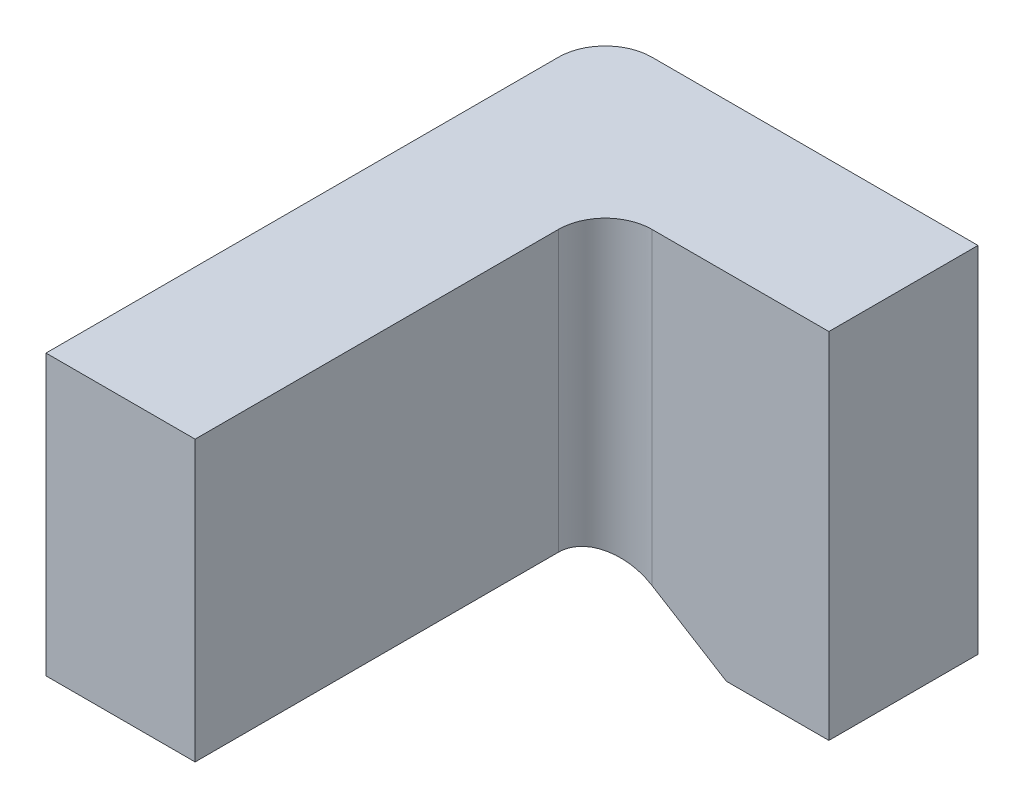
ISO-10303-21;
HEADER;
FILE_DESCRIPTION(('STEP AP214'),'2;1');
FILE_NAME('part.step','',(''),(''),'','','');
FILE_SCHEMA(('AUTOMOTIVE_DESIGN { 1 0 10303 214 1 1 1 1 }'));
ENDSEC;
DATA;
#1=APPLICATION_CONTEXT('core data for automotive mechanical design processes');
#2=APPLICATION_PROTOCOL_DEFINITION('international standard','automotive_design',2000,#1);
#3=PRODUCT_CONTEXT('',#1,'mechanical');
#4=PRODUCT('Part','Part','',(#3));
#5=PRODUCT_RELATED_PRODUCT_CATEGORY('part','',(#4));
#6=PRODUCT_DEFINITION_FORMATION('','',#4);
#7=PRODUCT_DEFINITION_CONTEXT('part definition',#1,'design');
#8=PRODUCT_DEFINITION('design','',#6,#7);
#9=PRODUCT_DEFINITION_SHAPE('','',#8);
#10=(LENGTH_UNIT() NAMED_UNIT(*) SI_UNIT(.MILLI.,.METRE.));
#11=(NAMED_UNIT(*) PLANE_ANGLE_UNIT() SI_UNIT($,.RADIAN.));
#12=(NAMED_UNIT(*) SI_UNIT($,.STERADIAN.) SOLID_ANGLE_UNIT());
#13=UNCERTAINTY_MEASURE_WITH_UNIT(LENGTH_MEASURE(1.E-05),#10,'distance_accuracy_value','');
#14=(GEOMETRIC_REPRESENTATION_CONTEXT(3) GLOBAL_UNCERTAINTY_ASSIGNED_CONTEXT((#13)) GLOBAL_UNIT_ASSIGNED_CONTEXT((#10,
#11,#12)) REPRESENTATION_CONTEXT('',''));
#15=CARTESIAN_POINT('',(0.,0.,0.));
#16=DIRECTION('',(0.,0.,1.));
#17=DIRECTION('',(1.,0.,0.));
#18=AXIS2_PLACEMENT_3D('',#15,#16,#17);
#19=CARTESIAN_POINT('',(0.,0.,0.16));
#20=DIRECTION('',(0.,0.,-1.));
#21=DIRECTION('',(-1.,0.,0.));
#22=AXIS2_PLACEMENT_3D('',#19,#20,#21);
#23=PLANE('',#22);
#24=DIRECTION('',(-1.,0.,0.));
#25=VECTOR('',#24,1.);
#26=CARTESIAN_POINT('',(0.,0.,0.16));
#27=LINE('',#26,#25);
#28=CARTESIAN_POINT('',(0.4,0.,0.16));
#29=VERTEX_POINT('',#28);
#30=CARTESIAN_POINT('',(0.21,0.,0.16));
#31=VERTEX_POINT('',#30);
#32=EDGE_CURVE('E168',#29,#31,#27,.T.);
#33=ORIENTED_EDGE('',*,*,#32,.T.);
#34=DIRECTION('',(0.,1.,0.));
#35=VECTOR('',#34,1.);
#36=CARTESIAN_POINT('',(0.21,-0.3,0.16));
#37=LINE('',#36,#35);
#38=CARTESIAN_POINT('',(0.21,-0.330769230769231,0.16));
#39=VERTEX_POINT('',#38);
#40=EDGE_CURVE('E216',#31,#39,#37,.F.);
#41=ORIENTED_EDGE('',*,*,#40,.T.);
#42=DIRECTION('',(0.851658316704544,-0.524097425664335,0.));
#43=VECTOR('',#42,1.);
#44=CARTESIAN_POINT('',(0.29,-0.38,0.16));
#45=LINE('',#44,#43);
#46=CARTESIAN_POINT('',(0.29,-0.38,0.16));
#47=VERTEX_POINT('',#46);
#48=EDGE_CURVE('E158',#39,#47,#45,.T.);
#49=ORIENTED_EDGE('',*,*,#48,.T.);
#50=DIRECTION('',(1.,0.,0.));
#51=VECTOR('',#50,1.);
#52=CARTESIAN_POINT('',(0.4,-0.38,0.16));
#53=LINE('',#52,#51);
#54=CARTESIAN_POINT('',(0.4,-0.38,0.16));
#55=VERTEX_POINT('',#54);
#56=EDGE_CURVE('E161',#47,#55,#53,.T.);
#57=ORIENTED_EDGE('',*,*,#56,.T.);
#58=DIRECTION('',(0.,1.,0.));
#59=VECTOR('',#58,1.);
#60=CARTESIAN_POINT('',(0.4,0.,0.16));
#61=LINE('',#60,#59);
#62=EDGE_CURVE('E165',#55,#29,#61,.T.);
#63=ORIENTED_EDGE('',*,*,#62,.T.);
#64=EDGE_LOOP('',(#33,#41,#49,#57,#63));
#65=FACE_BOUND('',#64,.T.);
#66=ADVANCED_FACE('F45',(#65),#23,.F.);
#67=CARTESIAN_POINT('',(0.,-0.3,0.16));
#68=DIRECTION('',(1.,0.,0.));
#69=DIRECTION('',(0.,0.,-1.));
#70=AXIS2_PLACEMENT_3D('',#67,#68,#69);
#71=PLANE('',#70);
#72=DIRECTION('',(0.,0.,-1.));
#73=VECTOR('',#72,1.);
#74=CARTESIAN_POINT('',(0.,0.,0.16));
#75=LINE('',#74,#73);
#76=CARTESIAN_POINT('',(0.,0.,0.6));
#77=VERTEX_POINT('',#76);
#78=CARTESIAN_POINT('',(0.,0.,0.05));
#79=VERTEX_POINT('',#78);
#80=EDGE_CURVE('E171',#77,#79,#75,.T.);
#81=ORIENTED_EDGE('',*,*,#80,.T.);
#82=DIRECTION('',(0.,-1.,0.));
#83=VECTOR('',#82,1.);
#84=CARTESIAN_POINT('',(0.,-0.3,0.05));
#85=LINE('',#84,#83);
#86=CARTESIAN_POINT('',(0.,-0.3,0.05));
#87=VERTEX_POINT('',#86);
#88=EDGE_CURVE('E129',#79,#87,#85,.T.);
#89=ORIENTED_EDGE('',*,*,#88,.T.);
#90=DIRECTION('',(0.,0.,-1.));
#91=VECTOR('',#90,1.);
#92=CARTESIAN_POINT('',(0.,-0.3,0.16));
#93=LINE('',#92,#91);
#94=CARTESIAN_POINT('',(0.,-0.3,0.6));
#95=VERTEX_POINT('',#94);
#96=EDGE_CURVE('E122',#95,#87,#93,.T.);
#97=ORIENTED_EDGE('',*,*,#96,.F.);
#98=DIRECTION('',(0.,-1.,0.));
#99=VECTOR('',#98,1.);
#100=CARTESIAN_POINT('',(0.,0.,0.6));
#101=LINE('',#100,#99);
#102=EDGE_CURVE('E127',#77,#95,#101,.T.);
#103=ORIENTED_EDGE('',*,*,#102,.F.);
#104=EDGE_LOOP('',(#81,#89,#97,#103));
#105=FACE_BOUND('',#104,.T.);
#106=ADVANCED_FACE('F125',(#105),#71,.F.);
#107=CARTESIAN_POINT('',(0.16,-0.3,0.16));
#108=DIRECTION('',(0.,1.,0.));
#109=DIRECTION('',(-1.,0.,0.));
#110=AXIS2_PLACEMENT_3D('',#107,#108,#109);
#111=PLANE('',#110);
#112=ORIENTED_EDGE('',*,*,#96,.T.);
#113=CARTESIAN_POINT('',(0.05,-0.3,0.05));
#114=DIRECTION('',(0.,1.,0.));
#115=DIRECTION('',(-1.,0.,0.));
#116=AXIS2_PLACEMENT_3D('',#113,#114,#115);
#117=CIRCLE('',#116,0.05);
#118=CARTESIAN_POINT('',(0.05,-0.3,0.));
#119=VERTEX_POINT('',#118);
#120=EDGE_CURVE('E203',#87,#119,#117,.F.);
#121=ORIENTED_EDGE('',*,*,#120,.T.);
#122=DIRECTION('',(1.,0.,0.));
#123=VECTOR('',#122,1.);
#124=CARTESIAN_POINT('',(0.16,-0.3,0.));
#125=LINE('',#124,#123);
#126=CARTESIAN_POINT('',(0.16,-0.3,0.));
#127=VERTEX_POINT('',#126);
#128=EDGE_CURVE('E157',#119,#127,#125,.T.);
#129=ORIENTED_EDGE('',*,*,#128,.T.);
#130=DIRECTION('',(0.,0.,-1.));
#131=VECTOR('',#130,1.);
#132=CARTESIAN_POINT('',(0.16,-0.3,0.16));
#133=LINE('',#132,#131);
#134=CARTESIAN_POINT('',(0.16,-0.3,0.21));
#135=VERTEX_POINT('',#134);
#136=EDGE_CURVE('E61',#135,#127,#133,.T.);
#137=ORIENTED_EDGE('',*,*,#136,.F.);
#138=DIRECTION('',(0.,0.,-1.));
#139=VECTOR('',#138,1.);
#140=CARTESIAN_POINT('',(0.16,-0.3,0.6));
#141=LINE('',#140,#139);
#142=CARTESIAN_POINT('',(0.16,-0.3,0.6));
#143=VERTEX_POINT('',#142);
#144=EDGE_CURVE('E134',#143,#135,#141,.T.);
#145=ORIENTED_EDGE('',*,*,#144,.F.);
#146=DIRECTION('',(1.,0.,0.));
#147=VECTOR('',#146,1.);
#148=CARTESIAN_POINT('',(0.,-0.3,0.6));
#149=LINE('',#148,#147);
#150=EDGE_CURVE('E132',#95,#143,#149,.T.);
#151=ORIENTED_EDGE('',*,*,#150,.F.);
#152=EDGE_LOOP('',(#112,#121,#129,#137,#145,#151));
#153=FACE_BOUND('',#152,.T.);
#154=ADVANCED_FACE('F133',(#153),#111,.F.);
#155=CARTESIAN_POINT('',(0.29,-0.38,0.16));
#156=DIRECTION('',(0.524097425664335,0.851658316704544,0.));
#157=DIRECTION('',(-0.851658316704544,0.524097425664335,0.));
#158=AXIS2_PLACEMENT_3D('',#155,#156,#157);
#159=PLANE('',#158);
#160=DIRECTION('',(0.851658316704544,-0.524097425664335,0.));
#161=VECTOR('',#160,1.);
#162=CARTESIAN_POINT('',(0.29,-0.38,0.));
#163=LINE('',#162,#161);
#164=CARTESIAN_POINT('',(0.29,-0.38,0.));
#165=VERTEX_POINT('',#164);
#166=EDGE_CURVE('E174',#127,#165,#163,.T.);
#167=ORIENTED_EDGE('',*,*,#166,.T.);
#168=DIRECTION('',(0.,0.,-1.));
#169=VECTOR('',#168,1.);
#170=CARTESIAN_POINT('',(0.29,-0.38,0.16));
#171=LINE('',#170,#169);
#172=EDGE_CURVE('E196',#47,#165,#171,.T.);
#173=ORIENTED_EDGE('',*,*,#172,.F.);
#174=ORIENTED_EDGE('',*,*,#48,.F.);
#175=CARTESIAN_POINT('',(0.21,-0.330769230769231,0.21));
#176=DIRECTION('',(0.524097425664335,0.851658316704544,0.));
#177=DIRECTION('',(0.851658316704544,-0.524097425664335,0.));
#178=AXIS2_PLACEMENT_3D('',#175,#176,#177);
#179=ELLIPSE('',#178,0.0587089904710529,0.05);
#180=EDGE_CURVE('E11',#39,#135,#179,.T.);
#181=ORIENTED_EDGE('',*,*,#180,.T.);
#182=ORIENTED_EDGE('',*,*,#136,.T.);
#183=EDGE_LOOP('',(#167,#173,#174,#181,#182));
#184=FACE_BOUND('',#183,.T.);
#185=ADVANCED_FACE('F226',(#184),#159,.F.);
#186=CARTESIAN_POINT('',(0.4,-0.38,0.16));
#187=DIRECTION('',(0.,1.,0.));
#188=DIRECTION('',(-1.,0.,0.));
#189=AXIS2_PLACEMENT_3D('',#186,#187,#188);
#190=PLANE('',#189);
#191=DIRECTION('',(1.,0.,0.));
#192=VECTOR('',#191,1.);
#193=CARTESIAN_POINT('',(0.4,-0.38,0.));
#194=LINE('',#193,#192);
#195=CARTESIAN_POINT('',(0.4,-0.38,0.));
#196=VERTEX_POINT('',#195);
#197=EDGE_CURVE('E177',#165,#196,#194,.T.);
#198=ORIENTED_EDGE('',*,*,#197,.T.);
#199=DIRECTION('',(0.,0.,-1.));
#200=VECTOR('',#199,1.);
#201=CARTESIAN_POINT('',(0.4,-0.38,0.16));
#202=LINE('',#201,#200);
#203=EDGE_CURVE('E192',#55,#196,#202,.T.);
#204=ORIENTED_EDGE('',*,*,#203,.F.);
#205=ORIENTED_EDGE('',*,*,#56,.F.);
#206=ORIENTED_EDGE('',*,*,#172,.T.);
#207=EDGE_LOOP('',(#198,#204,#205,#206));
#208=FACE_BOUND('',#207,.T.);
#209=ADVANCED_FACE('F245',(#208),#190,.F.);
#210=CARTESIAN_POINT('',(0.4,0.,0.16));
#211=DIRECTION('',(-1.,0.,0.));
#212=DIRECTION('',(0.,-1.,0.));
#213=AXIS2_PLACEMENT_3D('',#210,#211,#212);
#214=PLANE('',#213);
#215=DIRECTION('',(0.,1.,0.));
#216=VECTOR('',#215,1.);
#217=CARTESIAN_POINT('',(0.4,0.,0.));
#218=LINE('',#217,#216);
#219=CARTESIAN_POINT('',(0.4,0.,0.));
#220=VERTEX_POINT('',#219);
#221=EDGE_CURVE('E180',#196,#220,#218,.T.);
#222=ORIENTED_EDGE('',*,*,#221,.T.);
#223=DIRECTION('',(0.,0.,-1.));
#224=VECTOR('',#223,1.);
#225=CARTESIAN_POINT('',(0.4,0.,0.16));
#226=LINE('',#225,#224);
#227=EDGE_CURVE('E188',#29,#220,#226,.T.);
#228=ORIENTED_EDGE('',*,*,#227,.F.);
#229=ORIENTED_EDGE('',*,*,#62,.F.);
#230=ORIENTED_EDGE('',*,*,#203,.T.);
#231=EDGE_LOOP('',(#222,#228,#229,#230));
#232=FACE_BOUND('',#231,.T.);
#233=ADVANCED_FACE('F250',(#232),#214,.F.);
#234=CARTESIAN_POINT('',(0.,0.,0.16));
#235=DIRECTION('',(0.,-1.,0.));
#236=DIRECTION('',(0.,0.,-1.));
#237=AXIS2_PLACEMENT_3D('',#234,#235,#236);
#238=PLANE('',#237);
#239=DIRECTION('',(-1.,0.,0.));
#240=VECTOR('',#239,1.);
#241=CARTESIAN_POINT('',(0.,0.,0.));
#242=LINE('',#241,#240);
#243=CARTESIAN_POINT('',(0.05,0.,0.));
#244=VERTEX_POINT('',#243);
#245=EDGE_CURVE('E162',#220,#244,#242,.T.);
#246=ORIENTED_EDGE('',*,*,#245,.T.);
#247=CARTESIAN_POINT('',(0.05,0.,0.05));
#248=DIRECTION('',(0.,-1.,0.));
#249=DIRECTION('',(0.,0.,-1.));
#250=AXIS2_PLACEMENT_3D('',#247,#248,#249);
#251=CIRCLE('',#250,0.05);
#252=EDGE_CURVE('E209',#244,#79,#251,.F.);
#253=ORIENTED_EDGE('',*,*,#252,.T.);
#254=ORIENTED_EDGE('',*,*,#80,.F.);
#255=DIRECTION('',(-1.,0.,0.));
#256=VECTOR('',#255,1.);
#257=CARTESIAN_POINT('',(0.,0.,0.6));
#258=LINE('',#257,#256);
#259=CARTESIAN_POINT('',(0.16,0.,0.6));
#260=VERTEX_POINT('',#259);
#261=EDGE_CURVE('E143',#260,#77,#258,.T.);
#262=ORIENTED_EDGE('',*,*,#261,.F.);
#263=DIRECTION('',(0.,0.,-1.));
#264=VECTOR('',#263,1.);
#265=CARTESIAN_POINT('',(0.16,0.,0.6));
#266=LINE('',#265,#264);
#267=CARTESIAN_POINT('',(0.16,0.,0.21));
#268=VERTEX_POINT('',#267);
#269=EDGE_CURVE('E153',#260,#268,#266,.T.);
#270=ORIENTED_EDGE('',*,*,#269,.T.);
#271=CARTESIAN_POINT('',(0.21,0.,0.21));
#272=DIRECTION('',(0.,-1.,0.));
#273=DIRECTION('',(0.,0.,-1.));
#274=AXIS2_PLACEMENT_3D('',#271,#272,#273);
#275=CIRCLE('',#274,0.05);
#276=EDGE_CURVE('E54',#268,#31,#275,.T.);
#277=ORIENTED_EDGE('',*,*,#276,.T.);
#278=ORIENTED_EDGE('',*,*,#32,.F.);
#279=ORIENTED_EDGE('',*,*,#227,.T.);
#280=EDGE_LOOP('',(#246,#253,#254,#262,#270,#277,#278,#279));
#281=FACE_BOUND('',#280,.T.);
#282=ADVANCED_FACE('F232',(#281),#238,.F.);
#283=CARTESIAN_POINT('',(0.,0.,0.));
#284=DIRECTION('',(0.,0.,-1.));
#285=DIRECTION('',(-1.,0.,0.));
#286=AXIS2_PLACEMENT_3D('',#283,#284,#285);
#287=PLANE('',#286);
#288=ORIENTED_EDGE('',*,*,#128,.F.);
#289=DIRECTION('',(0.,-1.,0.));
#290=VECTOR('',#289,1.);
#291=CARTESIAN_POINT('',(0.05,0.,0.));
#292=LINE('',#291,#290);
#293=EDGE_CURVE('E206',#119,#244,#292,.F.);
#294=ORIENTED_EDGE('',*,*,#293,.T.);
#295=ORIENTED_EDGE('',*,*,#245,.F.);
#296=ORIENTED_EDGE('',*,*,#221,.F.);
#297=ORIENTED_EDGE('',*,*,#197,.F.);
#298=ORIENTED_EDGE('',*,*,#166,.F.);
#299=EDGE_LOOP('',(#288,#294,#295,#296,#297,#298));
#300=FACE_BOUND('',#299,.T.);
#301=ADVANCED_FACE('F240',(#300),#287,.T.);
#302=CARTESIAN_POINT('',(0.16,0.,0.6));
#303=DIRECTION('',(-1.,0.,0.));
#304=DIRECTION('',(0.,-1.,0.));
#305=AXIS2_PLACEMENT_3D('',#302,#303,#304);
#306=PLANE('',#305);
#307=ORIENTED_EDGE('',*,*,#144,.T.);
#308=DIRECTION('',(0.,1.,0.));
#309=VECTOR('',#308,1.);
#310=CARTESIAN_POINT('',(0.16,0.,0.21));
#311=LINE('',#310,#309);
#312=EDGE_CURVE('E212',#135,#268,#311,.T.);
#313=ORIENTED_EDGE('',*,*,#312,.T.);
#314=ORIENTED_EDGE('',*,*,#269,.F.);
#315=DIRECTION('',(0.,1.,0.));
#316=VECTOR('',#315,1.);
#317=CARTESIAN_POINT('',(0.16,0.,0.6));
#318=LINE('',#317,#316);
#319=EDGE_CURVE('E138',#143,#260,#318,.T.);
#320=ORIENTED_EDGE('',*,*,#319,.F.);
#321=EDGE_LOOP('',(#307,#313,#314,#320));
#322=FACE_BOUND('',#321,.T.);
#323=ADVANCED_FACE('F231',(#322),#306,.F.);
#324=CARTESIAN_POINT('',(0.,0.,0.6));
#325=DIRECTION('',(0.,0.,1.));
#326=DIRECTION('',(1.,0.,0.));
#327=AXIS2_PLACEMENT_3D('',#324,#325,#326);
#328=PLANE('',#327);
#329=ORIENTED_EDGE('',*,*,#102,.T.);
#330=ORIENTED_EDGE('',*,*,#150,.T.);
#331=ORIENTED_EDGE('',*,*,#319,.T.);
#332=ORIENTED_EDGE('',*,*,#261,.T.);
#333=EDGE_LOOP('',(#329,#330,#331,#332));
#334=FACE_BOUND('',#333,.T.);
#335=ADVANCED_FACE('F141',(#334),#328,.T.);
#336=CARTESIAN_POINT('',(0.05,-0.3,0.05));
#337=DIRECTION('',(0.,1.,0.));
#338=DIRECTION('',(0.,0.,1.));
#339=AXIS2_PLACEMENT_3D('',#336,#337,#338);
#340=CYLINDRICAL_SURFACE('',#339,0.05);
#341=ORIENTED_EDGE('',*,*,#252,.F.);
#342=ORIENTED_EDGE('',*,*,#293,.F.);
#343=ORIENTED_EDGE('',*,*,#120,.F.);
#344=ORIENTED_EDGE('',*,*,#88,.F.);
#345=EDGE_LOOP('',(#341,#342,#343,#344));
#346=FACE_BOUND('',#345,.T.);
#347=ADVANCED_FACE('F235',(#346),#340,.T.);
#348=CARTESIAN_POINT('',(0.21,0.,0.21));
#349=DIRECTION('',(0.,-1.,0.));
#350=DIRECTION('',(1.,0.,0.));
#351=AXIS2_PLACEMENT_3D('',#348,#349,#350);
#352=CYLINDRICAL_SURFACE('',#351,0.05);
#353=ORIENTED_EDGE('',*,*,#180,.F.);
#354=ORIENTED_EDGE('',*,*,#40,.F.);
#355=ORIENTED_EDGE('',*,*,#276,.F.);
#356=ORIENTED_EDGE('',*,*,#312,.F.);
#357=EDGE_LOOP('',(#353,#354,#355,#356));
#358=FACE_BOUND('',#357,.T.);
#359=ADVANCED_FACE('F47',(#358),#352,.F.);
#360=CLOSED_SHELL('',(#66,#106,#154,#185,#209,#233,#282,#301,#323,#335,#347,#359));
#361=MANIFOLD_SOLID_BREP('B2',#360);
#362=ADVANCED_BREP_SHAPE_REPRESENTATION('',(#18,#361),#14);
#363=SHAPE_DEFINITION_REPRESENTATION(#9,#362);
ENDSEC;
END-ISO-10303-21;
